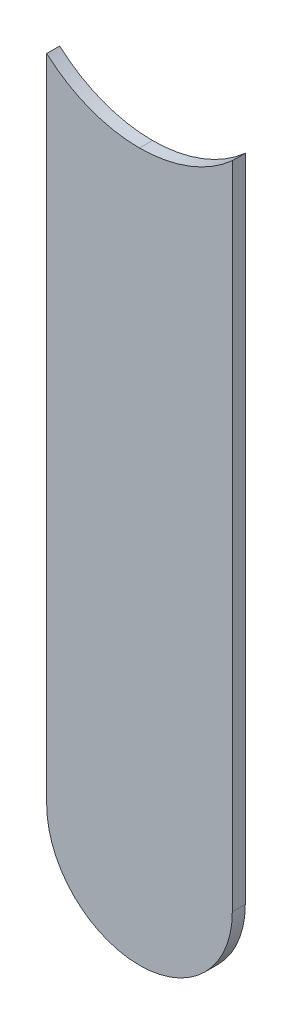
ISO-10303-21;
HEADER;
FILE_DESCRIPTION(('STEP AP214'),'2;1');
FILE_NAME('part.step','',(''),(''),'','','');
FILE_SCHEMA(('AUTOMOTIVE_DESIGN { 1 0 10303 214 1 1 1 1 }'));
ENDSEC;
DATA;
#1=APPLICATION_CONTEXT('core data for automotive mechanical design processes');
#2=APPLICATION_PROTOCOL_DEFINITION('international standard','automotive_design',2000,#1);
#3=PRODUCT_CONTEXT('',#1,'mechanical');
#4=PRODUCT('Part','Part','',(#3));
#5=PRODUCT_RELATED_PRODUCT_CATEGORY('part','',(#4));
#6=PRODUCT_DEFINITION_FORMATION('','',#4);
#7=PRODUCT_DEFINITION_CONTEXT('part definition',#1,'design');
#8=PRODUCT_DEFINITION('design','',#6,#7);
#9=PRODUCT_DEFINITION_SHAPE('','',#8);
#10=(LENGTH_UNIT() NAMED_UNIT(*) SI_UNIT(.MILLI.,.METRE.));
#11=(NAMED_UNIT(*) PLANE_ANGLE_UNIT() SI_UNIT($,.RADIAN.));
#12=(NAMED_UNIT(*) SI_UNIT($,.STERADIAN.) SOLID_ANGLE_UNIT());
#13=UNCERTAINTY_MEASURE_WITH_UNIT(LENGTH_MEASURE(1.E-05),#10,'distance_accuracy_value','');
#14=(GEOMETRIC_REPRESENTATION_CONTEXT(3) GLOBAL_UNCERTAINTY_ASSIGNED_CONTEXT((#13)) GLOBAL_UNIT_ASSIGNED_CONTEXT((#10,
#11,#12)) REPRESENTATION_CONTEXT('',''));
#15=CARTESIAN_POINT('',(0.,0.,0.));
#16=DIRECTION('',(0.,0.,1.));
#17=DIRECTION('',(1.,0.,0.));
#18=AXIS2_PLACEMENT_3D('',#15,#16,#17);
#19=CARTESIAN_POINT('',(155.19,-82.804,-0.035));
#20=DIRECTION('',(-1.,0.,0.));
#21=DIRECTION('',(0.,0.,1.));
#22=AXIS2_PLACEMENT_3D('',#19,#20,#21);
#23=PLANE('',#22);
#24=DIRECTION('',(0.,0.,-1.));
#25=VECTOR('',#24,1.);
#26=CARTESIAN_POINT('',(155.19,-81.05150849718,-0.045));
#27=LINE('',#26,#25);
#28=CARTESIAN_POINT('',(155.19,-81.05150849717,0.));
#29=VERTEX_POINT('',#28);
#30=CARTESIAN_POINT('',(155.19,-81.05150849717,-0.035));
#31=VERTEX_POINT('',#30);
#32=EDGE_CURVE('E11',#29,#31,#27,.T.);
#33=ORIENTED_EDGE('',*,*,#32,.F.);
#34=DIRECTION('',(0.,1.,0.));
#35=VECTOR('',#34,1.);
#36=CARTESIAN_POINT('',(155.19,-82.804,0.));
#37=LINE('',#36,#35);
#38=CARTESIAN_POINT('',(155.19,-82.804,0.));
#39=VERTEX_POINT('',#38);
#40=EDGE_CURVE('E74',#39,#29,#37,.T.);
#41=ORIENTED_EDGE('',*,*,#40,.F.);
#42=DIRECTION('',(0.,0.,1.));
#43=VECTOR('',#42,1.);
#44=CARTESIAN_POINT('',(155.19,-82.804,-0.035));
#45=LINE('',#44,#43);
#46=CARTESIAN_POINT('',(155.19,-82.804,-0.035));
#47=VERTEX_POINT('',#46);
#48=EDGE_CURVE('E68',#47,#39,#45,.T.);
#49=ORIENTED_EDGE('',*,*,#48,.F.);
#50=DIRECTION('',(0.,1.,0.));
#51=VECTOR('',#50,1.);
#52=CARTESIAN_POINT('',(155.19,-82.804,-0.035));
#53=LINE('',#52,#51);
#54=EDGE_CURVE('E71',#47,#31,#53,.T.);
#55=ORIENTED_EDGE('',*,*,#54,.T.);
#56=EDGE_LOOP('',(#33,#41,#49,#55));
#57=FACE_BOUND('',#56,.T.);
#58=ADVANCED_FACE('F17',(#57),#23,.F.);
#59=CARTESIAN_POINT('',(154.94,-80.772,-0.045));
#60=DIRECTION('',(0.,0.,-1.));
#61=DIRECTION('',(0.,-1.,0.));
#62=AXIS2_PLACEMENT_3D('',#59,#60,#61);
#63=CYLINDRICAL_SURFACE('',#62,0.375);
#64=CARTESIAN_POINT('',(154.94,-80.772,-0.035));
#65=DIRECTION('',(0.,0.,-1.));
#66=DIRECTION('',(0.,-1.,0.));
#67=AXIS2_PLACEMENT_3D('',#64,#65,#66);
#68=CIRCLE('',#67,0.375);
#69=CARTESIAN_POINT('',(154.94,-81.147,-0.035));
#70=VERTEX_POINT('',#69);
#71=EDGE_CURVE('E95',#31,#70,#68,.T.);
#72=ORIENTED_EDGE('',*,*,#71,.T.);
#73=DIRECTION('',(0.,0.,1.));
#74=VECTOR('',#73,1.);
#75=CARTESIAN_POINT('',(154.94,-81.147,-0.045));
#76=LINE('',#75,#74);
#77=CARTESIAN_POINT('',(154.94,-81.147,0.));
#78=VERTEX_POINT('',#77);
#79=EDGE_CURVE('E26',#70,#78,#76,.T.);
#80=ORIENTED_EDGE('',*,*,#79,.T.);
#81=CARTESIAN_POINT('',(154.94,-80.772,0.));
#82=DIRECTION('',(0.,0.,-1.));
#83=DIRECTION('',(0.,-1.,0.));
#84=AXIS2_PLACEMENT_3D('',#81,#82,#83);
#85=CIRCLE('',#84,0.375);
#86=EDGE_CURVE('E108',#29,#78,#85,.T.);
#87=ORIENTED_EDGE('',*,*,#86,.F.);
#88=ORIENTED_EDGE('',*,*,#32,.T.);
#89=EDGE_LOOP('',(#72,#80,#87,#88));
#90=FACE_BOUND('',#89,.T.);
#91=ADVANCED_FACE('F215',(#90),#63,.F.);
#92=CARTESIAN_POINT('',(154.94,-80.772,-0.045));
#93=DIRECTION('',(0.,0.,-1.));
#94=DIRECTION('',(0.,-1.,0.));
#95=AXIS2_PLACEMENT_3D('',#92,#93,#94);
#96=CYLINDRICAL_SURFACE('',#95,0.375);
#97=ORIENTED_EDGE('',*,*,#79,.F.);
#98=CARTESIAN_POINT('',(154.94,-80.772,-0.035));
#99=DIRECTION('',(0.,0.,-1.));
#100=DIRECTION('',(0.,-1.,0.));
#101=AXIS2_PLACEMENT_3D('',#98,#99,#100);
#102=CIRCLE('',#101,0.375);
#103=CARTESIAN_POINT('',(154.69,-81.05150849718,-0.035));
#104=VERTEX_POINT('',#103);
#105=EDGE_CURVE('E79',#70,#104,#102,.T.);
#106=ORIENTED_EDGE('',*,*,#105,.T.);
#107=DIRECTION('',(0.,0.,-1.));
#108=VECTOR('',#107,1.);
#109=CARTESIAN_POINT('',(154.69,-81.05150849718,-0.045));
#110=LINE('',#109,#108);
#111=CARTESIAN_POINT('',(154.69,-81.05150849718,0.));
#112=VERTEX_POINT('',#111);
#113=EDGE_CURVE('E131',#112,#104,#110,.T.);
#114=ORIENTED_EDGE('',*,*,#113,.F.);
#115=CARTESIAN_POINT('',(154.94,-80.772,0.));
#116=DIRECTION('',(0.,0.,-1.));
#117=DIRECTION('',(0.,-1.,0.));
#118=AXIS2_PLACEMENT_3D('',#115,#116,#117);
#119=CIRCLE('',#118,0.375);
#120=EDGE_CURVE('E109',#78,#112,#119,.T.);
#121=ORIENTED_EDGE('',*,*,#120,.F.);
#122=EDGE_LOOP('',(#97,#106,#114,#121));
#123=FACE_BOUND('',#122,.T.);
#124=ADVANCED_FACE('F132',(#123),#96,.F.);
#125=CARTESIAN_POINT('',(154.69,-80.772,0.));
#126=DIRECTION('',(0.,0.,1.));
#127=DIRECTION('',(1.,0.,0.));
#128=AXIS2_PLACEMENT_3D('',#125,#126,#127);
#129=PLANE('',#128);
#130=ORIENTED_EDGE('',*,*,#120,.T.);
#131=DIRECTION('',(0.,-1.,0.));
#132=VECTOR('',#131,1.);
#133=CARTESIAN_POINT('',(154.69,-80.772,0.));
#134=LINE('',#133,#132);
#135=CARTESIAN_POINT('',(154.69,-82.804,0.));
#136=VERTEX_POINT('',#135);
#137=EDGE_CURVE('E128',#112,#136,#134,.T.);
#138=ORIENTED_EDGE('',*,*,#137,.T.);
#139=CARTESIAN_POINT('',(154.94,-82.804,0.));
#140=DIRECTION('',(0.,0.,1.));
#141=DIRECTION('',(-1.,0.,0.));
#142=AXIS2_PLACEMENT_3D('',#139,#140,#141);
#143=CIRCLE('',#142,0.25);
#144=EDGE_CURVE('E78',#136,#39,#143,.T.);
#145=ORIENTED_EDGE('',*,*,#144,.T.);
#146=ORIENTED_EDGE('',*,*,#40,.T.);
#147=ORIENTED_EDGE('',*,*,#86,.T.);
#148=EDGE_LOOP('',(#130,#138,#145,#146,#147));
#149=FACE_BOUND('',#148,.T.);
#150=ADVANCED_FACE('F126',(#149),#129,.T.);
#151=CARTESIAN_POINT('',(154.94,-82.804,-0.035));
#152=DIRECTION('',(0.,0.,-1.));
#153=DIRECTION('',(-1.,0.,0.));
#154=AXIS2_PLACEMENT_3D('',#151,#152,#153);
#155=CYLINDRICAL_SURFACE('',#154,0.25);
#156=CARTESIAN_POINT('',(154.94,-82.804,-0.035));
#157=DIRECTION('',(0.,0.,1.));
#158=DIRECTION('',(-1.,0.,0.));
#159=AXIS2_PLACEMENT_3D('',#156,#157,#158);
#160=CIRCLE('',#159,0.25);
#161=CARTESIAN_POINT('',(154.69,-82.804,-0.035));
#162=VERTEX_POINT('',#161);
#163=EDGE_CURVE('E83',#162,#47,#160,.T.);
#164=ORIENTED_EDGE('',*,*,#163,.T.);
#165=ORIENTED_EDGE('',*,*,#48,.T.);
#166=ORIENTED_EDGE('',*,*,#144,.F.);
#167=DIRECTION('',(0.,0.,1.));
#168=VECTOR('',#167,1.);
#169=CARTESIAN_POINT('',(154.69,-82.804,-0.035));
#170=LINE('',#169,#168);
#171=EDGE_CURVE('E86',#162,#136,#170,.T.);
#172=ORIENTED_EDGE('',*,*,#171,.F.);
#173=EDGE_LOOP('',(#164,#165,#166,#172));
#174=FACE_BOUND('',#173,.T.);
#175=ADVANCED_FACE('F84',(#174),#155,.T.);
#176=CARTESIAN_POINT('',(154.69,-80.772,-0.035));
#177=DIRECTION('',(0.,0.,1.));
#178=DIRECTION('',(1.,0.,0.));
#179=AXIS2_PLACEMENT_3D('',#176,#177,#178);
#180=PLANE('',#179);
#181=ORIENTED_EDGE('',*,*,#71,.F.);
#182=ORIENTED_EDGE('',*,*,#54,.F.);
#183=ORIENTED_EDGE('',*,*,#163,.F.);
#184=DIRECTION('',(0.,-1.,0.));
#185=VECTOR('',#184,1.);
#186=CARTESIAN_POINT('',(154.69,-80.772,-0.035));
#187=LINE('',#186,#185);
#188=EDGE_CURVE('E102',#104,#162,#187,.T.);
#189=ORIENTED_EDGE('',*,*,#188,.F.);
#190=ORIENTED_EDGE('',*,*,#105,.F.);
#191=EDGE_LOOP('',(#181,#182,#183,#189,#190));
#192=FACE_BOUND('',#191,.T.);
#193=ADVANCED_FACE('F92',(#192),#180,.F.);
#194=CARTESIAN_POINT('',(154.69,-80.772,-0.035));
#195=DIRECTION('',(1.,0.,0.));
#196=DIRECTION('',(0.,1.,0.));
#197=AXIS2_PLACEMENT_3D('',#194,#195,#196);
#198=PLANE('',#197);
#199=ORIENTED_EDGE('',*,*,#171,.T.);
#200=ORIENTED_EDGE('',*,*,#137,.F.);
#201=ORIENTED_EDGE('',*,*,#113,.T.);
#202=ORIENTED_EDGE('',*,*,#188,.T.);
#203=EDGE_LOOP('',(#199,#200,#201,#202));
#204=FACE_BOUND('',#203,.T.);
#205=ADVANCED_FACE('F135',(#204),#198,.F.);
#206=CLOSED_SHELL('',(#58,#91,#124,#150,#175,#193,#205));
#207=MANIFOLD_SOLID_BREP('B1',#206);
#208=ADVANCED_BREP_SHAPE_REPRESENTATION('',(#18,#207),#14);
#209=SHAPE_DEFINITION_REPRESENTATION(#9,#208);
ENDSEC;
END-ISO-10303-21;
